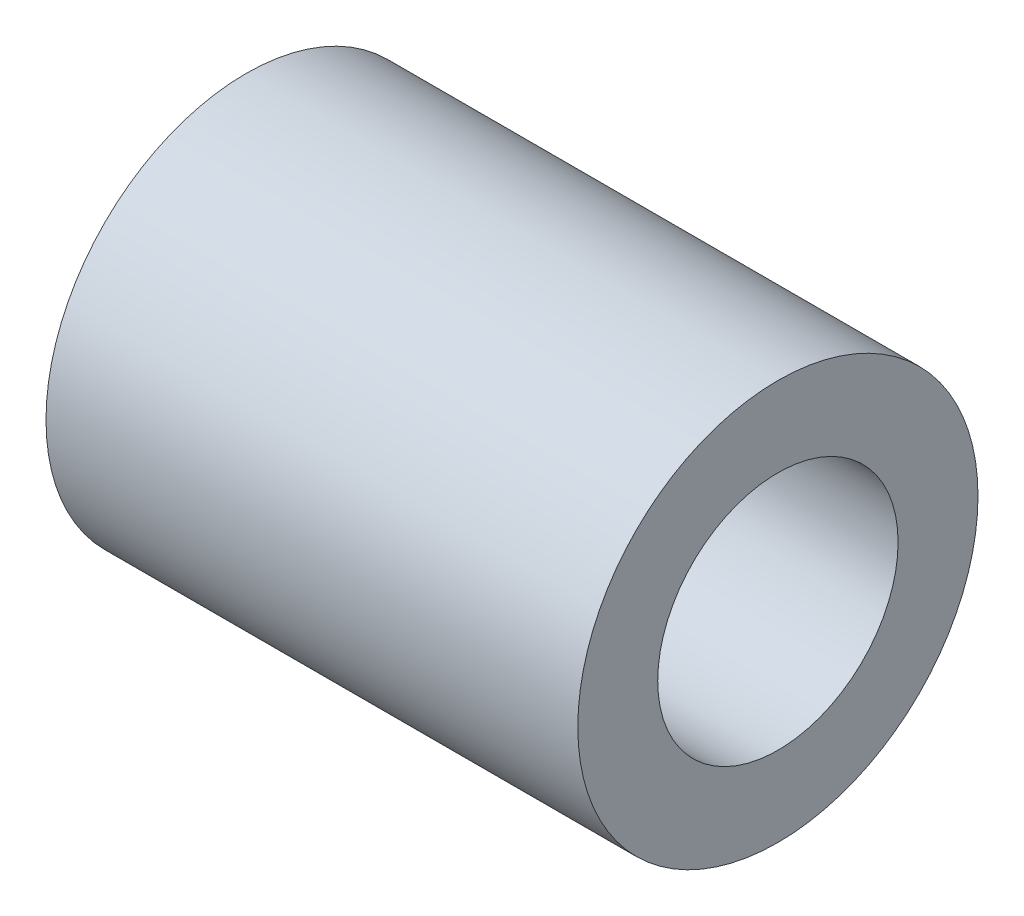
ISO-10303-21;
HEADER;
FILE_DESCRIPTION(('STEP AP214'),'2;1');
FILE_NAME('part.step','',(''),(''),'','','');
FILE_SCHEMA(('AUTOMOTIVE_DESIGN { 1 0 10303 214 1 1 1 1 }'));
ENDSEC;
DATA;
#1=APPLICATION_CONTEXT('core data for automotive mechanical design processes');
#2=APPLICATION_PROTOCOL_DEFINITION('international standard','automotive_design',2000,#1);
#3=PRODUCT_CONTEXT('',#1,'mechanical');
#4=PRODUCT('Part','Part','',(#3));
#5=PRODUCT_RELATED_PRODUCT_CATEGORY('part','',(#4));
#6=PRODUCT_DEFINITION_FORMATION('','',#4);
#7=PRODUCT_DEFINITION_CONTEXT('part definition',#1,'design');
#8=PRODUCT_DEFINITION('design','',#6,#7);
#9=PRODUCT_DEFINITION_SHAPE('','',#8);
#10=(LENGTH_UNIT() NAMED_UNIT(*) SI_UNIT(.MILLI.,.METRE.));
#11=(NAMED_UNIT(*) PLANE_ANGLE_UNIT() SI_UNIT($,.RADIAN.));
#12=(NAMED_UNIT(*) SI_UNIT($,.STERADIAN.) SOLID_ANGLE_UNIT());
#13=UNCERTAINTY_MEASURE_WITH_UNIT(LENGTH_MEASURE(1.E-05),#10,'distance_accuracy_value','');
#14=(GEOMETRIC_REPRESENTATION_CONTEXT(3) GLOBAL_UNCERTAINTY_ASSIGNED_CONTEXT((#13)) GLOBAL_UNIT_ASSIGNED_CONTEXT((#10,
#11,#12)) REPRESENTATION_CONTEXT('',''));
#15=CARTESIAN_POINT('',(0.,0.,0.));
#16=DIRECTION('',(0.,0.,1.));
#17=DIRECTION('',(1.,0.,0.));
#18=AXIS2_PLACEMENT_3D('',#15,#16,#17);
#19=CARTESIAN_POINT('',(35.4,0.,0.));
#20=DIRECTION('',(1.,0.,0.));
#21=DIRECTION('',(0.,0.,-1.));
#22=AXIS2_PLACEMENT_3D('',#19,#20,#21);
#23=PLANE('',#22);
#24=CARTESIAN_POINT('',(35.4,0.,0.));
#25=DIRECTION('',(1.,0.,0.));
#26=DIRECTION('',(0.,0.,-1.));
#27=AXIS2_PLACEMENT_3D('',#24,#25,#26);
#28=CIRCLE('',#27,13.32);
#29=CARTESIAN_POINT('',(35.4,0.,-13.32));
#30=VERTEX_POINT('',#29);
#31=EDGE_CURVE('E10',#30,#30,#28,.T.);
#32=ORIENTED_EDGE('',*,*,#31,.T.);
#33=EDGE_LOOP('',(#32));
#34=FACE_BOUND('',#33,.T.);
#35=CARTESIAN_POINT('',(35.4,0.,0.));
#36=DIRECTION('',(1.,0.,0.));
#37=DIRECTION('',(0.,0.,-1.));
#38=AXIS2_PLACEMENT_3D('',#35,#36,#37);
#39=CIRCLE('',#38,8.);
#40=CARTESIAN_POINT('',(35.4,0.,-8.));
#41=VERTEX_POINT('',#40);
#42=EDGE_CURVE('E42',#41,#41,#39,.T.);
#43=ORIENTED_EDGE('',*,*,#42,.F.);
#44=EDGE_LOOP('',(#43));
#45=FACE_BOUND('',#44,.T.);
#46=ADVANCED_FACE('F31',(#34,#45),#23,.T.);
#47=CARTESIAN_POINT('',(0.,0.,0.));
#48=DIRECTION('',(1.,0.,0.));
#49=DIRECTION('',(0.,0.,-1.));
#50=AXIS2_PLACEMENT_3D('',#47,#48,#49);
#51=PLANE('',#50);
#52=CARTESIAN_POINT('',(0.,0.,0.));
#53=DIRECTION('',(1.,0.,0.));
#54=DIRECTION('',(0.,0.,-1.));
#55=AXIS2_PLACEMENT_3D('',#52,#53,#54);
#56=CIRCLE('',#55,13.32);
#57=CARTESIAN_POINT('',(0.,0.,-13.32));
#58=VERTEX_POINT('',#57);
#59=EDGE_CURVE('E35',#58,#58,#56,.T.);
#60=ORIENTED_EDGE('',*,*,#59,.F.);
#61=EDGE_LOOP('',(#60));
#62=FACE_BOUND('',#61,.T.);
#63=CARTESIAN_POINT('',(0.,0.,0.));
#64=DIRECTION('',(1.,0.,0.));
#65=DIRECTION('',(0.,0.,-1.));
#66=AXIS2_PLACEMENT_3D('',#63,#64,#65);
#67=CIRCLE('',#66,8.);
#68=CARTESIAN_POINT('',(0.,0.,-8.));
#69=VERTEX_POINT('',#68);
#70=EDGE_CURVE('E44',#69,#69,#67,.T.);
#71=ORIENTED_EDGE('',*,*,#70,.T.);
#72=EDGE_LOOP('',(#71));
#73=FACE_BOUND('',#72,.T.);
#74=ADVANCED_FACE('F54',(#62,#73),#51,.F.);
#75=CARTESIAN_POINT('',(35.4,0.,0.));
#76=DIRECTION('',(-1.,0.,0.));
#77=DIRECTION('',(0.,0.,1.));
#78=AXIS2_PLACEMENT_3D('',#75,#76,#77);
#79=CYLINDRICAL_SURFACE('',#78,13.32);
#80=ORIENTED_EDGE('',*,*,#31,.F.);
#81=EDGE_LOOP('',(#80));
#82=FACE_BOUND('',#81,.T.);
#83=ORIENTED_EDGE('',*,*,#59,.T.);
#84=EDGE_LOOP('',(#83));
#85=FACE_BOUND('',#84,.T.);
#86=ADVANCED_FACE('F33',(#82,#85),#79,.T.);
#87=CARTESIAN_POINT('',(35.4,0.,0.));
#88=DIRECTION('',(-1.,0.,0.));
#89=DIRECTION('',(0.,0.,1.));
#90=AXIS2_PLACEMENT_3D('',#87,#88,#89);
#91=CYLINDRICAL_SURFACE('',#90,8.);
#92=ORIENTED_EDGE('',*,*,#42,.T.);
#93=EDGE_LOOP('',(#92));
#94=FACE_BOUND('',#93,.T.);
#95=ORIENTED_EDGE('',*,*,#70,.F.);
#96=EDGE_LOOP('',(#95));
#97=FACE_BOUND('',#96,.T.);
#98=ADVANCED_FACE('F50',(#94,#97),#91,.F.);
#99=CLOSED_SHELL('',(#46,#74,#86,#98));
#100=MANIFOLD_SOLID_BREP('B2',#99);
#101=ADVANCED_BREP_SHAPE_REPRESENTATION('',(#18,#100),#14);
#102=SHAPE_DEFINITION_REPRESENTATION(#9,#101);
ENDSEC;
END-ISO-10303-21;
